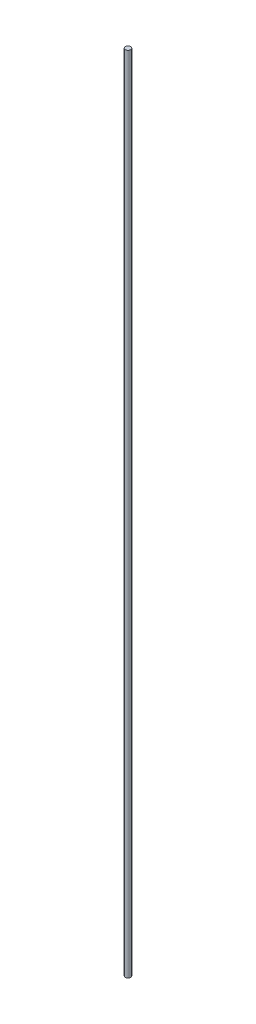
ISO-10303-21;
HEADER;
FILE_DESCRIPTION(('STEP AP214'),'2;1');
FILE_NAME('part.step','',(''),(''),'','','');
FILE_SCHEMA(('AUTOMOTIVE_DESIGN { 1 0 10303 214 1 1 1 1 }'));
ENDSEC;
DATA;
#1=APPLICATION_CONTEXT('core data for automotive mechanical design processes');
#2=APPLICATION_PROTOCOL_DEFINITION('international standard','automotive_design',2000,#1);
#3=PRODUCT_CONTEXT('',#1,'mechanical');
#4=PRODUCT('Part','Part','',(#3));
#5=PRODUCT_RELATED_PRODUCT_CATEGORY('part','',(#4));
#6=PRODUCT_DEFINITION_FORMATION('','',#4);
#7=PRODUCT_DEFINITION_CONTEXT('part definition',#1,'design');
#8=PRODUCT_DEFINITION('design','',#6,#7);
#9=PRODUCT_DEFINITION_SHAPE('','',#8);
#10=(LENGTH_UNIT() NAMED_UNIT(*) SI_UNIT(.MILLI.,.METRE.));
#11=(NAMED_UNIT(*) PLANE_ANGLE_UNIT() SI_UNIT($,.RADIAN.));
#12=(NAMED_UNIT(*) SI_UNIT($,.STERADIAN.) SOLID_ANGLE_UNIT());
#13=UNCERTAINTY_MEASURE_WITH_UNIT(LENGTH_MEASURE(1.E-05),#10,'distance_accuracy_value','');
#14=(GEOMETRIC_REPRESENTATION_CONTEXT(3) GLOBAL_UNCERTAINTY_ASSIGNED_CONTEXT((#13)) GLOBAL_UNIT_ASSIGNED_CONTEXT((#10,
#11,#12)) REPRESENTATION_CONTEXT('',''));
#15=CARTESIAN_POINT('',(0.,0.,0.));
#16=DIRECTION('',(0.,0.,1.));
#17=DIRECTION('',(1.,0.,0.));
#18=AXIS2_PLACEMENT_3D('',#15,#16,#17);
#19=CARTESIAN_POINT('',(0.,300.,0.));
#20=DIRECTION('',(0.,-1.,0.));
#21=DIRECTION('',(0.,0.,-1.));
#22=AXIS2_PLACEMENT_3D('',#19,#20,#21);
#23=CYLINDRICAL_SURFACE('',#22,1.);
#24=CARTESIAN_POINT('',(0.,300.,0.));
#25=DIRECTION('',(0.,1.,0.));
#26=DIRECTION('',(0.,0.,1.));
#27=AXIS2_PLACEMENT_3D('',#24,#25,#26);
#28=CIRCLE('',#27,1.);
#29=CARTESIAN_POINT('',(0.,300.,1.));
#30=VERTEX_POINT('',#29);
#31=EDGE_CURVE('E10',#30,#30,#28,.T.);
#32=ORIENTED_EDGE('',*,*,#31,.F.);
#33=EDGE_LOOP('',(#32));
#34=FACE_BOUND('',#33,.T.);
#35=CARTESIAN_POINT('',(0.,0.,0.));
#36=DIRECTION('',(0.,1.,0.));
#37=DIRECTION('',(0.,0.,1.));
#38=AXIS2_PLACEMENT_3D('',#35,#36,#37);
#39=CIRCLE('',#38,1.);
#40=CARTESIAN_POINT('',(0.,0.,1.));
#41=VERTEX_POINT('',#40);
#42=EDGE_CURVE('E34',#41,#41,#39,.T.);
#43=ORIENTED_EDGE('',*,*,#42,.T.);
#44=EDGE_LOOP('',(#43));
#45=FACE_BOUND('',#44,.T.);
#46=ADVANCED_FACE('F31',(#34,#45),#23,.T.);
#47=CARTESIAN_POINT('',(0.,300.,0.));
#48=DIRECTION('',(0.,1.,0.));
#49=DIRECTION('',(0.,0.,1.));
#50=AXIS2_PLACEMENT_3D('',#47,#48,#49);
#51=PLANE('',#50);
#52=ORIENTED_EDGE('',*,*,#31,.T.);
#53=EDGE_LOOP('',(#52));
#54=FACE_BOUND('',#53,.T.);
#55=ADVANCED_FACE('F46',(#54),#51,.T.);
#56=CARTESIAN_POINT('',(0.,0.,0.));
#57=DIRECTION('',(0.,1.,0.));
#58=DIRECTION('',(0.,0.,1.));
#59=AXIS2_PLACEMENT_3D('',#56,#57,#58);
#60=PLANE('',#59);
#61=ORIENTED_EDGE('',*,*,#42,.F.);
#62=EDGE_LOOP('',(#61));
#63=FACE_BOUND('',#62,.T.);
#64=ADVANCED_FACE('F44',(#63),#60,.F.);
#65=CLOSED_SHELL('',(#46,#55,#64));
#66=MANIFOLD_SOLID_BREP('B2',#65);
#67=ADVANCED_BREP_SHAPE_REPRESENTATION('',(#18,#66),#14);
#68=SHAPE_DEFINITION_REPRESENTATION(#9,#67);
ENDSEC;
END-ISO-10303-21;
